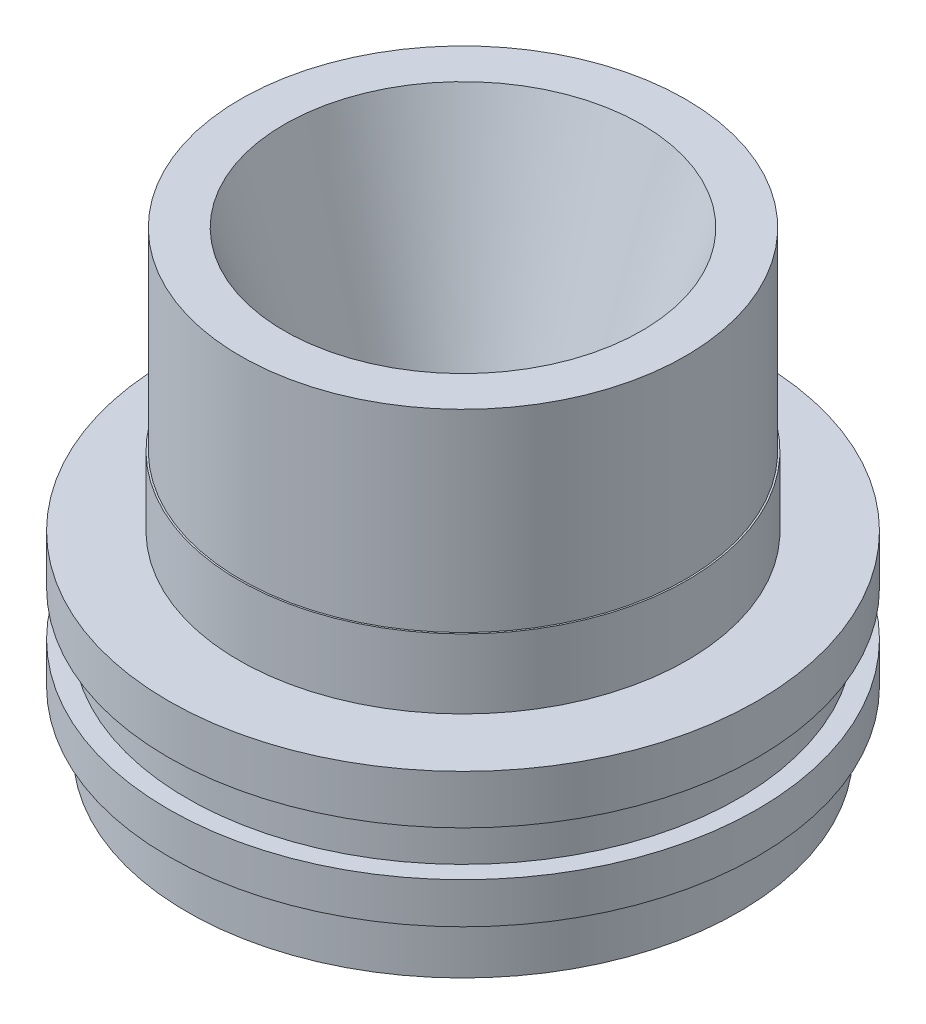
ISO-10303-21;
HEADER;
FILE_DESCRIPTION(('STEP AP214'),'2;1');
FILE_NAME('part.step','',(''),(''),'','','');
FILE_SCHEMA(('AUTOMOTIVE_DESIGN { 1 0 10303 214 1 1 1 1 }'));
ENDSEC;
DATA;
#1=APPLICATION_CONTEXT('core data for automotive mechanical design processes');
#2=APPLICATION_PROTOCOL_DEFINITION('international standard','automotive_design',2000,#1);
#3=PRODUCT_CONTEXT('',#1,'mechanical');
#4=PRODUCT('Part','Part','',(#3));
#5=PRODUCT_RELATED_PRODUCT_CATEGORY('part','',(#4));
#6=PRODUCT_DEFINITION_FORMATION('','',#4);
#7=PRODUCT_DEFINITION_CONTEXT('part definition',#1,'design');
#8=PRODUCT_DEFINITION('design','',#6,#7);
#9=PRODUCT_DEFINITION_SHAPE('','',#8);
#10=(LENGTH_UNIT() NAMED_UNIT(*) SI_UNIT(.MILLI.,.METRE.));
#11=(NAMED_UNIT(*) PLANE_ANGLE_UNIT() SI_UNIT($,.RADIAN.));
#12=(NAMED_UNIT(*) SI_UNIT($,.STERADIAN.) SOLID_ANGLE_UNIT());
#13=UNCERTAINTY_MEASURE_WITH_UNIT(LENGTH_MEASURE(1.E-05),#10,'distance_accuracy_value','');
#14=(GEOMETRIC_REPRESENTATION_CONTEXT(3) GLOBAL_UNCERTAINTY_ASSIGNED_CONTEXT((#13)) GLOBAL_UNIT_ASSIGNED_CONTEXT((#10,
#11,#12)) REPRESENTATION_CONTEXT('',''));
#15=CARTESIAN_POINT('',(0.,0.,0.));
#16=DIRECTION('',(0.,0.,1.));
#17=DIRECTION('',(1.,0.,0.));
#18=AXIS2_PLACEMENT_3D('',#15,#16,#17);
#19=CARTESIAN_POINT('',(0.,0.,0.));
#20=DIRECTION('',(0.,-1.,0.));
#21=DIRECTION('',(0.,0.,-1.));
#22=AXIS2_PLACEMENT_3D('',#19,#20,#21);
#23=CYLINDRICAL_SURFACE('',#22,42.926);
#24=CARTESIAN_POINT('',(0.,-57.9125072160261,0.));
#25=DIRECTION('',(0.,-1.,0.));
#26=DIRECTION('',(0.,0.,-1.));
#27=AXIS2_PLACEMENT_3D('',#24,#25,#26);
#28=CIRCLE('',#27,42.926);
#29=CARTESIAN_POINT('',(0.,-57.9125072160261,-42.926));
#30=VERTEX_POINT('',#29);
#31=EDGE_CURVE('E10',#30,#30,#28,.T.);
#32=ORIENTED_EDGE('',*,*,#31,.F.);
#33=EDGE_LOOP('',(#32));
#34=FACE_BOUND('',#33,.T.);
#35=CARTESIAN_POINT('',(0.,-48.9463072160261,0.));
#36=DIRECTION('',(0.,-1.,0.));
#37=DIRECTION('',(0.,0.,-1.));
#38=AXIS2_PLACEMENT_3D('',#35,#36,#37);
#39=CIRCLE('',#38,42.926);
#40=CARTESIAN_POINT('',(0.,-48.9463072160261,-42.926));
#41=VERTEX_POINT('',#40);
#42=EDGE_CURVE('E84',#41,#41,#39,.T.);
#43=ORIENTED_EDGE('',*,*,#42,.T.);
#44=EDGE_LOOP('',(#43));
#45=FACE_BOUND('',#44,.T.);
#46=ADVANCED_FACE('F32',(#34,#45),#23,.T.);
#47=CARTESIAN_POINT('',(-40.513,-57.9125072160261,0.));
#48=DIRECTION('',(0.,1.,0.));
#49=DIRECTION('',(0.,0.,1.));
#50=AXIS2_PLACEMENT_3D('',#47,#48,#49);
#51=PLANE('',#50);
#52=CARTESIAN_POINT('',(0.,-57.9125072160261,0.));
#53=DIRECTION('',(0.,-1.,0.));
#54=DIRECTION('',(0.,0.,-1.));
#55=AXIS2_PLACEMENT_3D('',#52,#53,#54);
#56=CIRCLE('',#55,40.513);
#57=CARTESIAN_POINT('',(0.,-57.9125072160261,-40.513));
#58=VERTEX_POINT('',#57);
#59=EDGE_CURVE('E38',#58,#58,#56,.T.);
#60=ORIENTED_EDGE('',*,*,#59,.F.);
#61=EDGE_LOOP('',(#60));
#62=FACE_BOUND('',#61,.T.);
#63=ORIENTED_EDGE('',*,*,#31,.T.);
#64=EDGE_LOOP('',(#63));
#65=FACE_BOUND('',#64,.T.);
#66=ADVANCED_FACE('F169',(#62,#65),#51,.F.);
#67=CARTESIAN_POINT('',(0.,-57.9125072160261,0.));
#68=DIRECTION('',(0.,-1.,0.));
#69=DIRECTION('',(0.,0.,-1.));
#70=AXIS2_PLACEMENT_3D('',#67,#68,#69);
#71=CONICAL_SURFACE('',#70,40.513,1.09589215761104);
#72=CARTESIAN_POINT('',(0.,-44.0695072160261,0.));
#73=DIRECTION('',(0.,-1.,0.));
#74=DIRECTION('',(0.,0.,-1.));
#75=AXIS2_PLACEMENT_3D('',#72,#73,#74);
#76=CIRCLE('',#75,13.589);
#77=CARTESIAN_POINT('',(0.,-44.0695072160261,-13.589));
#78=VERTEX_POINT('',#77);
#79=EDGE_CURVE('E42',#78,#78,#76,.T.);
#80=ORIENTED_EDGE('',*,*,#79,.F.);
#81=EDGE_LOOP('',(#80));
#82=FACE_BOUND('',#81,.T.);
#83=ORIENTED_EDGE('',*,*,#59,.T.);
#84=EDGE_LOOP('',(#83));
#85=FACE_BOUND('',#84,.T.);
#86=ADVANCED_FACE('F164',(#82,#85),#71,.F.);
#87=CARTESIAN_POINT('',(0.,0.,0.));
#88=DIRECTION('',(0.,-1.,0.));
#89=DIRECTION('',(0.,0.,-1.));
#90=AXIS2_PLACEMENT_3D('',#87,#88,#89);
#91=CYLINDRICAL_SURFACE('',#90,13.589);
#92=CARTESIAN_POINT('',(0.,-31.3695072160261,0.));
#93=DIRECTION('',(0.,-1.,0.));
#94=DIRECTION('',(0.,0.,-1.));
#95=AXIS2_PLACEMENT_3D('',#92,#93,#94);
#96=CIRCLE('',#95,13.589);
#97=CARTESIAN_POINT('',(0.,-31.3695072160261,-13.589));
#98=VERTEX_POINT('',#97);
#99=EDGE_CURVE('E46',#98,#98,#96,.T.);
#100=ORIENTED_EDGE('',*,*,#99,.F.);
#101=EDGE_LOOP('',(#100));
#102=FACE_BOUND('',#101,.T.);
#103=ORIENTED_EDGE('',*,*,#79,.T.);
#104=EDGE_LOOP('',(#103));
#105=FACE_BOUND('',#104,.T.);
#106=ADVANCED_FACE('F158',(#102,#105),#91,.F.);
#107=CARTESIAN_POINT('',(0.,-31.3695072160261,0.));
#108=DIRECTION('',(0.,1.,0.));
#109=DIRECTION('',(0.,0.,1.));
#110=AXIS2_PLACEMENT_3D('',#107,#108,#109);
#111=CONICAL_SURFACE('',#110,13.589,0.311294124886036);
#112=CARTESIAN_POINT('',(0.,12.9026927839739,0.));
#113=DIRECTION('',(0.,-1.,0.));
#114=DIRECTION('',(0.,0.,-1.));
#115=AXIS2_PLACEMENT_3D('',#112,#113,#114);
#116=CIRCLE('',#115,27.8338022557719);
#117=CARTESIAN_POINT('',(0.,12.9026927839739,-27.8338022557719));
#118=VERTEX_POINT('',#117);
#119=EDGE_CURVE('E51',#118,#118,#116,.T.);
#120=ORIENTED_EDGE('',*,*,#119,.F.);
#121=EDGE_LOOP('',(#120));
#122=FACE_BOUND('',#121,.T.);
#123=ORIENTED_EDGE('',*,*,#99,.T.);
#124=EDGE_LOOP('',(#123));
#125=FACE_BOUND('',#124,.T.);
#126=ADVANCED_FACE('F152',(#122,#125),#111,.F.);
#127=CARTESIAN_POINT('',(-34.6456,12.9026927839739,0.));
#128=DIRECTION('',(0.,-1.,0.));
#129=DIRECTION('',(0.,0.,-1.));
#130=AXIS2_PLACEMENT_3D('',#127,#128,#129);
#131=PLANE('',#130);
#132=CARTESIAN_POINT('',(0.,12.9026927839739,0.));
#133=DIRECTION('',(0.,-1.,0.));
#134=DIRECTION('',(0.,0.,-1.));
#135=AXIS2_PLACEMENT_3D('',#132,#133,#134);
#136=CIRCLE('',#135,34.6456);
#137=CARTESIAN_POINT('',(0.,12.9026927839739,-34.6456));
#138=VERTEX_POINT('',#137);
#139=EDGE_CURVE('E54',#138,#138,#136,.T.);
#140=ORIENTED_EDGE('',*,*,#139,.F.);
#141=EDGE_LOOP('',(#140));
#142=FACE_BOUND('',#141,.T.);
#143=ORIENTED_EDGE('',*,*,#119,.T.);
#144=EDGE_LOOP('',(#143));
#145=FACE_BOUND('',#144,.T.);
#146=ADVANCED_FACE('F146',(#142,#145),#131,.F.);
#147=CARTESIAN_POINT('',(0.,0.,0.));
#148=DIRECTION('',(0.,-1.,0.));
#149=DIRECTION('',(0.,0.,-1.));
#150=AXIS2_PLACEMENT_3D('',#147,#148,#149);
#151=CYLINDRICAL_SURFACE('',#150,34.6456);
#152=CARTESIAN_POINT('',(0.,-17.1963072160261,0.));
#153=DIRECTION('',(0.,-1.,0.));
#154=DIRECTION('',(0.,0.,-1.));
#155=AXIS2_PLACEMENT_3D('',#152,#153,#154);
#156=CIRCLE('',#155,34.6456);
#157=CARTESIAN_POINT('',(0.,-17.1963072160261,-34.6456));
#158=VERTEX_POINT('',#157);
#159=EDGE_CURVE('E57',#158,#158,#156,.T.);
#160=ORIENTED_EDGE('',*,*,#159,.F.);
#161=EDGE_LOOP('',(#160));
#162=FACE_BOUND('',#161,.T.);
#163=ORIENTED_EDGE('',*,*,#139,.T.);
#164=EDGE_LOOP('',(#163));
#165=FACE_BOUND('',#164,.T.);
#166=ADVANCED_FACE('F140',(#162,#165),#151,.T.);
#167=CARTESIAN_POINT('',(-34.8996,-17.1963072160261,0.));
#168=DIRECTION('',(0.,-1.,0.));
#169=DIRECTION('',(0.,0.,-1.));
#170=AXIS2_PLACEMENT_3D('',#167,#168,#169);
#171=PLANE('',#170);
#172=CARTESIAN_POINT('',(0.,-17.1963072160261,0.));
#173=DIRECTION('',(0.,-1.,0.));
#174=DIRECTION('',(0.,0.,-1.));
#175=AXIS2_PLACEMENT_3D('',#172,#173,#174);
#176=CIRCLE('',#175,34.8996);
#177=CARTESIAN_POINT('',(0.,-17.1963072160261,-34.8996));
#178=VERTEX_POINT('',#177);
#179=EDGE_CURVE('E60',#178,#178,#176,.T.);
#180=ORIENTED_EDGE('',*,*,#179,.F.);
#181=EDGE_LOOP('',(#180));
#182=FACE_BOUND('',#181,.T.);
#183=ORIENTED_EDGE('',*,*,#159,.T.);
#184=EDGE_LOOP('',(#183));
#185=FACE_BOUND('',#184,.T.);
#186=ADVANCED_FACE('F134',(#182,#185),#171,.F.);
#187=CARTESIAN_POINT('',(0.,0.,0.));
#188=DIRECTION('',(0.,-1.,0.));
#189=DIRECTION('',(0.,0.,-1.));
#190=AXIS2_PLACEMENT_3D('',#187,#188,#189);
#191=CYLINDRICAL_SURFACE('',#190,34.8996);
#192=CARTESIAN_POINT('',(0.,-27.9913072160261,0.));
#193=DIRECTION('',(0.,-1.,0.));
#194=DIRECTION('',(0.,0.,-1.));
#195=AXIS2_PLACEMENT_3D('',#192,#193,#194);
#196=CIRCLE('',#195,34.8996);
#197=CARTESIAN_POINT('',(0.,-27.9913072160261,-34.8996));
#198=VERTEX_POINT('',#197);
#199=EDGE_CURVE('E63',#198,#198,#196,.T.);
#200=ORIENTED_EDGE('',*,*,#199,.F.);
#201=EDGE_LOOP('',(#200));
#202=FACE_BOUND('',#201,.T.);
#203=ORIENTED_EDGE('',*,*,#179,.T.);
#204=EDGE_LOOP('',(#203));
#205=FACE_BOUND('',#204,.T.);
#206=ADVANCED_FACE('F128',(#202,#205),#191,.T.);
#207=CARTESIAN_POINT('',(-45.847,-27.9913072160261,0.));
#208=DIRECTION('',(0.,-1.,0.));
#209=DIRECTION('',(0.,0.,-1.));
#210=AXIS2_PLACEMENT_3D('',#207,#208,#209);
#211=PLANE('',#210);
#212=CARTESIAN_POINT('',(0.,-27.9913072160261,0.));
#213=DIRECTION('',(0.,-1.,0.));
#214=DIRECTION('',(0.,0.,-1.));
#215=AXIS2_PLACEMENT_3D('',#212,#213,#214);
#216=CIRCLE('',#215,45.847);
#217=CARTESIAN_POINT('',(0.,-27.9913072160261,-45.847));
#218=VERTEX_POINT('',#217);
#219=EDGE_CURVE('E66',#218,#218,#216,.T.);
#220=ORIENTED_EDGE('',*,*,#219,.F.);
#221=EDGE_LOOP('',(#220));
#222=FACE_BOUND('',#221,.T.);
#223=ORIENTED_EDGE('',*,*,#199,.T.);
#224=EDGE_LOOP('',(#223));
#225=FACE_BOUND('',#224,.T.);
#226=ADVANCED_FACE('F122',(#222,#225),#211,.F.);
#227=CARTESIAN_POINT('',(0.,0.,0.));
#228=DIRECTION('',(0.,-1.,0.));
#229=DIRECTION('',(0.,0.,-1.));
#230=AXIS2_PLACEMENT_3D('',#227,#228,#229);
#231=CYLINDRICAL_SURFACE('',#230,45.847);
#232=CARTESIAN_POINT('',(0.,-35.6113072160261,0.));
#233=DIRECTION('',(0.,-1.,0.));
#234=DIRECTION('',(0.,0.,-1.));
#235=AXIS2_PLACEMENT_3D('',#232,#233,#234);
#236=CIRCLE('',#235,45.847);
#237=CARTESIAN_POINT('',(0.,-35.6113072160261,-45.847));
#238=VERTEX_POINT('',#237);
#239=EDGE_CURVE('E69',#238,#238,#236,.T.);
#240=ORIENTED_EDGE('',*,*,#239,.F.);
#241=EDGE_LOOP('',(#240));
#242=FACE_BOUND('',#241,.T.);
#243=ORIENTED_EDGE('',*,*,#219,.T.);
#244=EDGE_LOOP('',(#243));
#245=FACE_BOUND('',#244,.T.);
#246=ADVANCED_FACE('F116',(#242,#245),#231,.T.);
#247=CARTESIAN_POINT('',(-42.926,-35.6113072160261,0.));
#248=DIRECTION('',(0.,1.,0.));
#249=DIRECTION('',(0.,0.,1.));
#250=AXIS2_PLACEMENT_3D('',#247,#248,#249);
#251=PLANE('',#250);
#252=CARTESIAN_POINT('',(0.,-35.6113072160261,0.));
#253=DIRECTION('',(0.,-1.,0.));
#254=DIRECTION('',(0.,0.,-1.));
#255=AXIS2_PLACEMENT_3D('',#252,#253,#254);
#256=CIRCLE('',#255,42.926);
#257=CARTESIAN_POINT('',(0.,-35.6113072160261,-42.926));
#258=VERTEX_POINT('',#257);
#259=EDGE_CURVE('E72',#258,#258,#256,.T.);
#260=ORIENTED_EDGE('',*,*,#259,.F.);
#261=EDGE_LOOP('',(#260));
#262=FACE_BOUND('',#261,.T.);
#263=ORIENTED_EDGE('',*,*,#239,.T.);
#264=EDGE_LOOP('',(#263));
#265=FACE_BOUND('',#264,.T.);
#266=ADVANCED_FACE('F110',(#262,#265),#251,.F.);
#267=CARTESIAN_POINT('',(0.,0.,0.));
#268=DIRECTION('',(0.,-1.,0.));
#269=DIRECTION('',(0.,0.,-1.));
#270=AXIS2_PLACEMENT_3D('',#267,#268,#269);
#271=CYLINDRICAL_SURFACE('',#270,42.926);
#272=CARTESIAN_POINT('',(0.,-42.5963072160261,0.));
#273=DIRECTION('',(0.,-1.,0.));
#274=DIRECTION('',(0.,0.,-1.));
#275=AXIS2_PLACEMENT_3D('',#272,#273,#274);
#276=CIRCLE('',#275,42.926);
#277=CARTESIAN_POINT('',(0.,-42.5963072160261,-42.926));
#278=VERTEX_POINT('',#277);
#279=EDGE_CURVE('E75',#278,#278,#276,.T.);
#280=ORIENTED_EDGE('',*,*,#279,.F.);
#281=EDGE_LOOP('',(#280));
#282=FACE_BOUND('',#281,.T.);
#283=ORIENTED_EDGE('',*,*,#259,.T.);
#284=EDGE_LOOP('',(#283));
#285=FACE_BOUND('',#284,.T.);
#286=ADVANCED_FACE('F104',(#282,#285),#271,.T.);
#287=CARTESIAN_POINT('',(-45.847,-42.5963072160261,0.));
#288=DIRECTION('',(0.,-1.,0.));
#289=DIRECTION('',(0.,0.,-1.));
#290=AXIS2_PLACEMENT_3D('',#287,#288,#289);
#291=PLANE('',#290);
#292=CARTESIAN_POINT('',(0.,-42.5963072160261,0.));
#293=DIRECTION('',(0.,-1.,0.));
#294=DIRECTION('',(0.,0.,-1.));
#295=AXIS2_PLACEMENT_3D('',#292,#293,#294);
#296=CIRCLE('',#295,45.847);
#297=CARTESIAN_POINT('',(0.,-42.5963072160261,-45.847));
#298=VERTEX_POINT('',#297);
#299=EDGE_CURVE('E78',#298,#298,#296,.T.);
#300=ORIENTED_EDGE('',*,*,#299,.F.);
#301=EDGE_LOOP('',(#300));
#302=FACE_BOUND('',#301,.T.);
#303=ORIENTED_EDGE('',*,*,#279,.T.);
#304=EDGE_LOOP('',(#303));
#305=FACE_BOUND('',#304,.T.);
#306=ADVANCED_FACE('F98',(#302,#305),#291,.F.);
#307=CARTESIAN_POINT('',(0.,0.,0.));
#308=DIRECTION('',(0.,-1.,0.));
#309=DIRECTION('',(0.,0.,-1.));
#310=AXIS2_PLACEMENT_3D('',#307,#308,#309);
#311=CYLINDRICAL_SURFACE('',#310,45.847);
#312=CARTESIAN_POINT('',(0.,-48.9463072160261,0.));
#313=DIRECTION('',(0.,-1.,0.));
#314=DIRECTION('',(0.,0.,-1.));
#315=AXIS2_PLACEMENT_3D('',#312,#313,#314);
#316=CIRCLE('',#315,45.847);
#317=CARTESIAN_POINT('',(0.,-48.9463072160261,-45.847));
#318=VERTEX_POINT('',#317);
#319=EDGE_CURVE('E81',#318,#318,#316,.T.);
#320=ORIENTED_EDGE('',*,*,#319,.F.);
#321=EDGE_LOOP('',(#320));
#322=FACE_BOUND('',#321,.T.);
#323=ORIENTED_EDGE('',*,*,#299,.T.);
#324=EDGE_LOOP('',(#323));
#325=FACE_BOUND('',#324,.T.);
#326=ADVANCED_FACE('F92',(#322,#325),#311,.T.);
#327=CARTESIAN_POINT('',(-42.926,-48.9463072160261,0.));
#328=DIRECTION('',(0.,1.,0.));
#329=DIRECTION('',(0.,0.,1.));
#330=AXIS2_PLACEMENT_3D('',#327,#328,#329);
#331=PLANE('',#330);
#332=ORIENTED_EDGE('',*,*,#42,.F.);
#333=EDGE_LOOP('',(#332));
#334=FACE_BOUND('',#333,.T.);
#335=ORIENTED_EDGE('',*,*,#319,.T.);
#336=EDGE_LOOP('',(#335));
#337=FACE_BOUND('',#336,.T.);
#338=ADVANCED_FACE('F89',(#334,#337),#331,.F.);
#339=CLOSED_SHELL('',(#46,#66,#86,#106,#126,#146,#166,#186,#206,#226,#246,#266,#286,#306,#326,#338));
#340=MANIFOLD_SOLID_BREP('B2',#339);
#341=ADVANCED_BREP_SHAPE_REPRESENTATION('',(#18,#340),#14);
#342=SHAPE_DEFINITION_REPRESENTATION(#9,#341);
ENDSEC;
END-ISO-10303-21;
